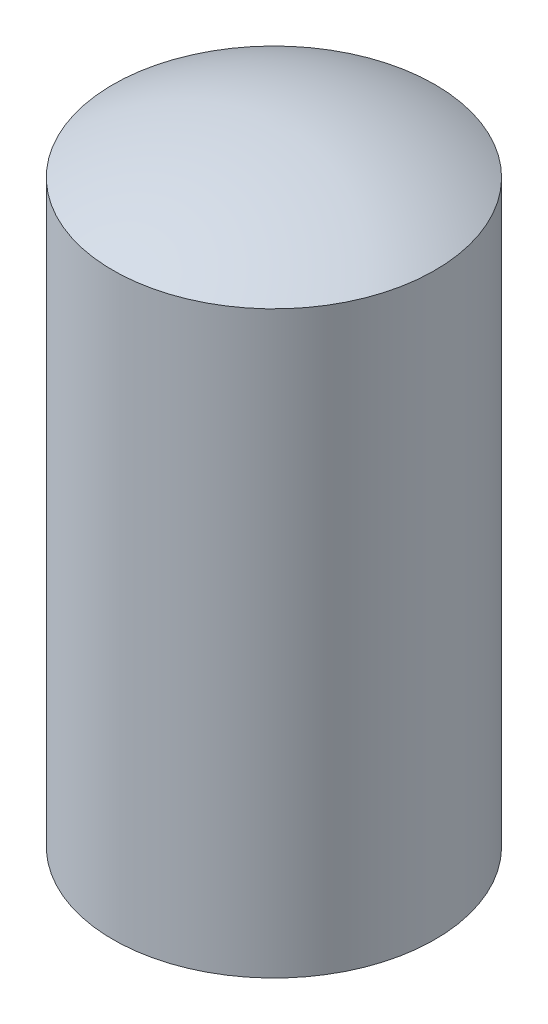
ISO-10303-21;
HEADER;
FILE_DESCRIPTION(('STEP AP214'),'2;1');
FILE_NAME('part.step','',(''),(''),'','','');
FILE_SCHEMA(('AUTOMOTIVE_DESIGN { 1 0 10303 214 1 1 1 1 }'));
ENDSEC;
DATA;
#1=APPLICATION_CONTEXT('core data for automotive mechanical design processes');
#2=APPLICATION_PROTOCOL_DEFINITION('international standard','automotive_design',2000,#1);
#3=PRODUCT_CONTEXT('',#1,'mechanical');
#4=PRODUCT('Part','Part','',(#3));
#5=PRODUCT_RELATED_PRODUCT_CATEGORY('part','',(#4));
#6=PRODUCT_DEFINITION_FORMATION('','',#4);
#7=PRODUCT_DEFINITION_CONTEXT('part definition',#1,'design');
#8=PRODUCT_DEFINITION('design','',#6,#7);
#9=PRODUCT_DEFINITION_SHAPE('','',#8);
#10=(LENGTH_UNIT() NAMED_UNIT(*) SI_UNIT(.MILLI.,.METRE.));
#11=(NAMED_UNIT(*) PLANE_ANGLE_UNIT() SI_UNIT($,.RADIAN.));
#12=(NAMED_UNIT(*) SI_UNIT($,.STERADIAN.) SOLID_ANGLE_UNIT());
#13=UNCERTAINTY_MEASURE_WITH_UNIT(LENGTH_MEASURE(1.E-05),#10,'distance_accuracy_value','');
#14=(GEOMETRIC_REPRESENTATION_CONTEXT(3) GLOBAL_UNCERTAINTY_ASSIGNED_CONTEXT((#13)) GLOBAL_UNIT_ASSIGNED_CONTEXT((#10,
#11,#12)) REPRESENTATION_CONTEXT('',''));
#15=CARTESIAN_POINT('',(0.,0.,0.));
#16=DIRECTION('',(0.,0.,1.));
#17=DIRECTION('',(1.,0.,0.));
#18=AXIS2_PLACEMENT_3D('',#15,#16,#17);
#19=CARTESIAN_POINT('',(0.,-27.6019237886467,0.9));
#20=DIRECTION('',(-1.,0.,0.));
#21=DIRECTION('',(0.,-1.,0.));
#22=AXIS2_PLACEMENT_3D('',#19,#20,#21);
#23=SPHERICAL_SURFACE('',#22,3.);
#24=CARTESIAN_POINT('',(0.,-27.6019237886467,0.9));
#25=DIRECTION('',(0.,1.,0.));
#26=DIRECTION('',(0.,0.,-1.));
#27=AXIS2_PLACEMENT_3D('',#24,#25,#26);
#28=SPHERICAL_SURFACE('',#27,3.);
#29=CARTESIAN_POINT('',(0.,-30.2,0.9));
#30=DIRECTION('',(0.,1.,0.));
#31=DIRECTION('',(0.,0.,-1.));
#32=AXIS2_PLACEMENT_3D('',#29,#30,#31);
#33=CIRCLE('',#32,1.5);
#34=CARTESIAN_POINT('',(0.,-30.2,-0.6));
#35=VERTEX_POINT('',#34);
#36=EDGE_CURVE('E11',#35,#35,#33,.T.);
#37=ORIENTED_EDGE('',*,*,#36,.F.);
#38=EDGE_LOOP('',(#37));
#39=FACE_BOUND('',#38,.T.);
#40=ADVANCED_FACE('F17',(#39),#28,.T.);
#41=CARTESIAN_POINT('',(0.,-27.3980762113533,0.9));
#42=DIRECTION('',(-1.,0.,0.));
#43=DIRECTION('',(0.,1.,0.));
#44=AXIS2_PLACEMENT_3D('',#41,#42,#43);
#45=SPHERICAL_SURFACE('',#44,3.);
#46=CARTESIAN_POINT('',(0.,-27.3980762113533,0.9));
#47=DIRECTION('',(0.,1.,0.));
#48=DIRECTION('',(0.,0.,-1.));
#49=AXIS2_PLACEMENT_3D('',#46,#47,#48);
#50=SPHERICAL_SURFACE('',#49,3.);
#51=CARTESIAN_POINT('',(0.,-24.8,0.9));
#52=DIRECTION('',(0.,1.,0.));
#53=DIRECTION('',(0.,0.,-1.));
#54=AXIS2_PLACEMENT_3D('',#51,#52,#53);
#55=CIRCLE('',#54,1.5);
#56=CARTESIAN_POINT('',(0.,-24.8,-0.6));
#57=VERTEX_POINT('',#56);
#58=EDGE_CURVE('E20',#57,#57,#55,.T.);
#59=ORIENTED_EDGE('',*,*,#58,.T.);
#60=EDGE_LOOP('',(#59));
#61=FACE_BOUND('',#60,.T.);
#62=ADVANCED_FACE('F39',(#61),#50,.T.);
#63=CARTESIAN_POINT('',(0.,-26.15,0.9));
#64=DIRECTION('',(0.,1.,0.));
#65=DIRECTION('',(0.,0.,-1.));
#66=AXIS2_PLACEMENT_3D('',#63,#64,#65);
#67=CYLINDRICAL_SURFACE('',#66,1.5);
#68=ORIENTED_EDGE('',*,*,#36,.T.);
#69=EDGE_LOOP('',(#68));
#70=FACE_BOUND('',#69,.T.);
#71=ORIENTED_EDGE('',*,*,#58,.F.);
#72=EDGE_LOOP('',(#71));
#73=FACE_BOUND('',#72,.T.);
#74=ADVANCED_FACE('F47',(#70,#73),#67,.T.);
#75=CLOSED_SHELL('',(#40,#62,#74));
#76=MANIFOLD_SOLID_BREP('B1',#75);
#77=ADVANCED_BREP_SHAPE_REPRESENTATION('',(#18,#76),#14);
#78=SHAPE_DEFINITION_REPRESENTATION(#9,#77);
ENDSEC;
END-ISO-10303-21;
